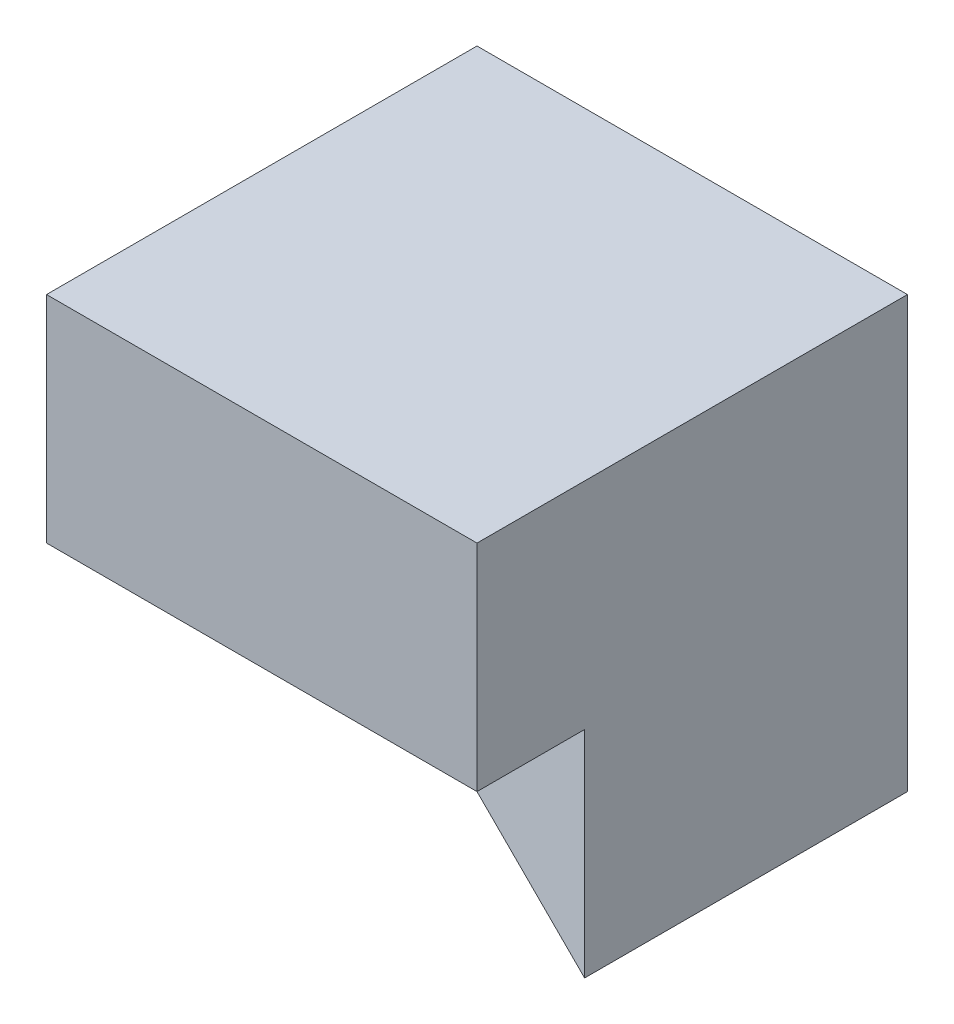
ISO-10303-21;
HEADER;
FILE_DESCRIPTION(('STEP AP214'),'2;1');
FILE_NAME('part.step','',(''),(''),'','','');
FILE_SCHEMA(('AUTOMOTIVE_DESIGN { 1 0 10303 214 1 1 1 1 }'));
ENDSEC;
DATA;
#1=APPLICATION_CONTEXT('core data for automotive mechanical design processes');
#2=APPLICATION_PROTOCOL_DEFINITION('international standard','automotive_design',2000,#1);
#3=PRODUCT_CONTEXT('',#1,'mechanical');
#4=PRODUCT('Part','Part','',(#3));
#5=PRODUCT_RELATED_PRODUCT_CATEGORY('part','',(#4));
#6=PRODUCT_DEFINITION_FORMATION('','',#4);
#7=PRODUCT_DEFINITION_CONTEXT('part definition',#1,'design');
#8=PRODUCT_DEFINITION('design','',#6,#7);
#9=PRODUCT_DEFINITION_SHAPE('','',#8);
#10=(LENGTH_UNIT() NAMED_UNIT(*) SI_UNIT(.MILLI.,.METRE.));
#11=(NAMED_UNIT(*) PLANE_ANGLE_UNIT() SI_UNIT($,.RADIAN.));
#12=(NAMED_UNIT(*) SI_UNIT($,.STERADIAN.) SOLID_ANGLE_UNIT());
#13=UNCERTAINTY_MEASURE_WITH_UNIT(LENGTH_MEASURE(1.E-05),#10,'distance_accuracy_value','');
#14=(GEOMETRIC_REPRESENTATION_CONTEXT(3) GLOBAL_UNCERTAINTY_ASSIGNED_CONTEXT((#13)) GLOBAL_UNIT_ASSIGNED_CONTEXT((#10,
#11,#12)) REPRESENTATION_CONTEXT('',''));
#15=CARTESIAN_POINT('',(0.,0.,0.));
#16=DIRECTION('',(0.,0.,1.));
#17=DIRECTION('',(1.,0.,0.));
#18=AXIS2_PLACEMENT_3D('',#15,#16,#17);
#19=CARTESIAN_POINT('',(0.,0.,40.));
#20=DIRECTION('',(1.,0.,0.));
#21=DIRECTION('',(0.,0.,-1.));
#22=AXIS2_PLACEMENT_3D('',#19,#20,#21);
#23=PLANE('',#22);
#24=DIRECTION('',(0.,0.,-1.));
#25=VECTOR('',#24,1.);
#26=CARTESIAN_POINT('',(0.,0.,40.));
#27=LINE('',#26,#25);
#28=CARTESIAN_POINT('',(0.,0.,10.));
#29=VERTEX_POINT('',#28);
#30=CARTESIAN_POINT('',(0.,0.,0.));
#31=VERTEX_POINT('',#30);
#32=EDGE_CURVE('E11',#29,#31,#27,.T.);
#33=ORIENTED_EDGE('',*,*,#32,.F.);
#34=DIRECTION('',(0.,-1.,0.));
#35=VECTOR('',#34,1.);
#36=CARTESIAN_POINT('',(0.,0.,10.));
#37=LINE('',#36,#35);
#38=CARTESIAN_POINT('',(0.,20.,10.));
#39=VERTEX_POINT('',#38);
#40=EDGE_CURVE('E121',#39,#29,#37,.T.);
#41=ORIENTED_EDGE('',*,*,#40,.F.);
#42=DIRECTION('',(0.,0.,-1.));
#43=VECTOR('',#42,1.);
#44=CARTESIAN_POINT('',(0.,20.,40.));
#45=LINE('',#44,#43);
#46=CARTESIAN_POINT('',(0.,20.,40.));
#47=VERTEX_POINT('',#46);
#48=EDGE_CURVE('E134',#47,#39,#45,.T.);
#49=ORIENTED_EDGE('',*,*,#48,.F.);
#50=DIRECTION('',(0.,-1.,0.));
#51=VECTOR('',#50,1.);
#52=CARTESIAN_POINT('',(0.,0.,40.));
#53=LINE('',#52,#51);
#54=CARTESIAN_POINT('',(0.,40.,40.));
#55=VERTEX_POINT('',#54);
#56=EDGE_CURVE('E84',#55,#47,#53,.T.);
#57=ORIENTED_EDGE('',*,*,#56,.F.);
#58=DIRECTION('',(0.,0.,-1.));
#59=VECTOR('',#58,1.);
#60=CARTESIAN_POINT('',(0.,40.,40.));
#61=LINE('',#60,#59);
#62=CARTESIAN_POINT('',(0.,40.,0.));
#63=VERTEX_POINT('',#62);
#64=EDGE_CURVE('E77',#55,#63,#61,.T.);
#65=ORIENTED_EDGE('',*,*,#64,.T.);
#66=DIRECTION('',(0.,-1.,0.));
#67=VECTOR('',#66,1.);
#68=CARTESIAN_POINT('',(0.,0.,0.));
#69=LINE('',#68,#67);
#70=EDGE_CURVE('E90',#63,#31,#69,.T.);
#71=ORIENTED_EDGE('',*,*,#70,.T.);
#72=EDGE_LOOP('',(#33,#41,#49,#57,#65,#71));
#73=FACE_BOUND('',#72,.T.);
#74=ADVANCED_FACE('F33',(#73),#23,.F.);
#75=CARTESIAN_POINT('',(0.,0.,40.));
#76=DIRECTION('',(0.,1.,0.));
#77=DIRECTION('',(0.,0.,1.));
#78=AXIS2_PLACEMENT_3D('',#75,#76,#77);
#79=PLANE('',#78);
#80=DIRECTION('',(0.,0.,-1.));
#81=VECTOR('',#80,1.);
#82=CARTESIAN_POINT('',(40.,0.,40.));
#83=LINE('',#82,#81);
#84=CARTESIAN_POINT('',(40.,0.,30.));
#85=VERTEX_POINT('',#84);
#86=CARTESIAN_POINT('',(40.,0.,0.));
#87=VERTEX_POINT('',#86);
#88=EDGE_CURVE('E40',#85,#87,#83,.T.);
#89=ORIENTED_EDGE('',*,*,#88,.F.);
#90=DIRECTION('',(0.894427190999916,0.,0.447213595499958));
#91=VECTOR('',#90,1.);
#92=CARTESIAN_POINT('',(0.,0.,10.));
#93=LINE('',#92,#91);
#94=EDGE_CURVE('E117',#29,#85,#93,.T.);
#95=ORIENTED_EDGE('',*,*,#94,.F.);
#96=ORIENTED_EDGE('',*,*,#32,.T.);
#97=DIRECTION('',(1.,0.,0.));
#98=VECTOR('',#97,1.);
#99=CARTESIAN_POINT('',(0.,0.,0.));
#100=LINE('',#99,#98);
#101=EDGE_CURVE('E96',#31,#87,#100,.T.);
#102=ORIENTED_EDGE('',*,*,#101,.T.);
#103=EDGE_LOOP('',(#89,#95,#96,#102));
#104=FACE_BOUND('',#103,.T.);
#105=ADVANCED_FACE('F115',(#104),#79,.F.);
#106=CARTESIAN_POINT('',(40.,0.,40.));
#107=DIRECTION('',(-1.,0.,0.));
#108=DIRECTION('',(0.,0.,1.));
#109=AXIS2_PLACEMENT_3D('',#106,#107,#108);
#110=PLANE('',#109);
#111=DIRECTION('',(0.,0.,-1.));
#112=VECTOR('',#111,1.);
#113=CARTESIAN_POINT('',(40.,20.,40.));
#114=LINE('',#113,#112);
#115=CARTESIAN_POINT('',(40.,20.,40.));
#116=VERTEX_POINT('',#115);
#117=CARTESIAN_POINT('',(40.,20.,30.));
#118=VERTEX_POINT('',#117);
#119=EDGE_CURVE('E47',#116,#118,#114,.T.);
#120=ORIENTED_EDGE('',*,*,#119,.T.);
#121=DIRECTION('',(0.,1.,0.));
#122=VECTOR('',#121,1.);
#123=CARTESIAN_POINT('',(40.,0.,30.));
#124=LINE('',#123,#122);
#125=EDGE_CURVE('E111',#85,#118,#124,.T.);
#126=ORIENTED_EDGE('',*,*,#125,.F.);
#127=ORIENTED_EDGE('',*,*,#88,.T.);
#128=DIRECTION('',(0.,1.,0.));
#129=VECTOR('',#128,1.);
#130=CARTESIAN_POINT('',(40.,0.,0.));
#131=LINE('',#130,#129);
#132=CARTESIAN_POINT('',(40.,40.,0.));
#133=VERTEX_POINT('',#132);
#134=EDGE_CURVE('E85',#87,#133,#131,.T.);
#135=ORIENTED_EDGE('',*,*,#134,.T.);
#136=DIRECTION('',(0.,0.,-1.));
#137=VECTOR('',#136,1.);
#138=CARTESIAN_POINT('',(40.,40.,40.));
#139=LINE('',#138,#137);
#140=CARTESIAN_POINT('',(40.,40.,40.));
#141=VERTEX_POINT('',#140);
#142=EDGE_CURVE('E80',#141,#133,#139,.T.);
#143=ORIENTED_EDGE('',*,*,#142,.F.);
#144=DIRECTION('',(0.,1.,0.));
#145=VECTOR('',#144,1.);
#146=CARTESIAN_POINT('',(40.,0.,40.));
#147=LINE('',#146,#145);
#148=EDGE_CURVE('E137',#116,#141,#147,.T.);
#149=ORIENTED_EDGE('',*,*,#148,.F.);
#150=EDGE_LOOP('',(#120,#126,#127,#135,#143,#149));
#151=FACE_BOUND('',#150,.T.);
#152=ADVANCED_FACE('F108',(#151),#110,.F.);
#153=CARTESIAN_POINT('',(0.,40.,40.));
#154=DIRECTION('',(0.,-1.,0.));
#155=DIRECTION('',(0.,0.,-1.));
#156=AXIS2_PLACEMENT_3D('',#153,#154,#155);
#157=PLANE('',#156);
#158=DIRECTION('',(-1.,0.,0.));
#159=VECTOR('',#158,1.);
#160=CARTESIAN_POINT('',(0.,40.,0.));
#161=LINE('',#160,#159);
#162=EDGE_CURVE('E74',#133,#63,#161,.T.);
#163=ORIENTED_EDGE('',*,*,#162,.T.);
#164=ORIENTED_EDGE('',*,*,#64,.F.);
#165=DIRECTION('',(-1.,0.,0.));
#166=VECTOR('',#165,1.);
#167=CARTESIAN_POINT('',(0.,40.,40.));
#168=LINE('',#167,#166);
#169=EDGE_CURVE('E56',#141,#55,#168,.T.);
#170=ORIENTED_EDGE('',*,*,#169,.F.);
#171=ORIENTED_EDGE('',*,*,#142,.T.);
#172=EDGE_LOOP('',(#163,#164,#170,#171));
#173=FACE_BOUND('',#172,.T.);
#174=ADVANCED_FACE('F76',(#173),#157,.F.);
#175=CARTESIAN_POINT('',(0.,0.,40.));
#176=DIRECTION('',(0.,0.,-1.));
#177=DIRECTION('',(-1.,0.,0.));
#178=AXIS2_PLACEMENT_3D('',#175,#176,#177);
#179=PLANE('',#178);
#180=ORIENTED_EDGE('',*,*,#56,.T.);
#181=DIRECTION('',(-1.,0.,0.));
#182=VECTOR('',#181,1.);
#183=CARTESIAN_POINT('',(40.,20.,40.));
#184=LINE('',#183,#182);
#185=EDGE_CURVE('E97',#116,#47,#184,.T.);
#186=ORIENTED_EDGE('',*,*,#185,.F.);
#187=ORIENTED_EDGE('',*,*,#148,.T.);
#188=ORIENTED_EDGE('',*,*,#169,.T.);
#189=EDGE_LOOP('',(#180,#186,#187,#188));
#190=FACE_BOUND('',#189,.T.);
#191=ADVANCED_FACE('F142',(#190),#179,.F.);
#192=CARTESIAN_POINT('',(0.,0.,0.));
#193=DIRECTION('',(0.,0.,-1.));
#194=DIRECTION('',(-1.,0.,0.));
#195=AXIS2_PLACEMENT_3D('',#192,#193,#194);
#196=PLANE('',#195);
#197=ORIENTED_EDGE('',*,*,#70,.F.);
#198=ORIENTED_EDGE('',*,*,#162,.F.);
#199=ORIENTED_EDGE('',*,*,#134,.F.);
#200=ORIENTED_EDGE('',*,*,#101,.F.);
#201=EDGE_LOOP('',(#197,#198,#199,#200));
#202=FACE_BOUND('',#201,.T.);
#203=ADVANCED_FACE('F94',(#202),#196,.T.);
#204=CARTESIAN_POINT('',(40.,20.,40.));
#205=DIRECTION('',(0.,1.,0.));
#206=DIRECTION('',(0.,0.,1.));
#207=AXIS2_PLACEMENT_3D('',#204,#205,#206);
#208=PLANE('',#207);
#209=ORIENTED_EDGE('',*,*,#48,.T.);
#210=DIRECTION('',(0.894427190999916,0.,0.447213595499958));
#211=VECTOR('',#210,1.);
#212=CARTESIAN_POINT('',(0.,20.,10.));
#213=LINE('',#212,#211);
#214=EDGE_CURVE('E130',#39,#118,#213,.T.);
#215=ORIENTED_EDGE('',*,*,#214,.T.);
#216=ORIENTED_EDGE('',*,*,#119,.F.);
#217=ORIENTED_EDGE('',*,*,#185,.T.);
#218=EDGE_LOOP('',(#209,#215,#216,#217));
#219=FACE_BOUND('',#218,.T.);
#220=ADVANCED_FACE('F133',(#219),#208,.F.);
#221=CARTESIAN_POINT('',(0.,0.,10.));
#222=DIRECTION('',(-0.447213595499958,0.,0.894427190999916));
#223=DIRECTION('',(0.894427190999916,0.,0.447213595499958));
#224=AXIS2_PLACEMENT_3D('',#221,#222,#223);
#225=PLANE('',#224);
#226=ORIENTED_EDGE('',*,*,#214,.F.);
#227=ORIENTED_EDGE('',*,*,#40,.T.);
#228=ORIENTED_EDGE('',*,*,#94,.T.);
#229=ORIENTED_EDGE('',*,*,#125,.T.);
#230=EDGE_LOOP('',(#226,#227,#228,#229));
#231=FACE_BOUND('',#230,.T.);
#232=ADVANCED_FACE('F129',(#231),#225,.T.);
#233=CLOSED_SHELL('',(#74,#105,#152,#174,#191,#203,#220,#232));
#234=MANIFOLD_SOLID_BREP('B2',#233);
#235=ADVANCED_BREP_SHAPE_REPRESENTATION('',(#18,#234),#14);
#236=SHAPE_DEFINITION_REPRESENTATION(#9,#235);
ENDSEC;
END-ISO-10303-21;
